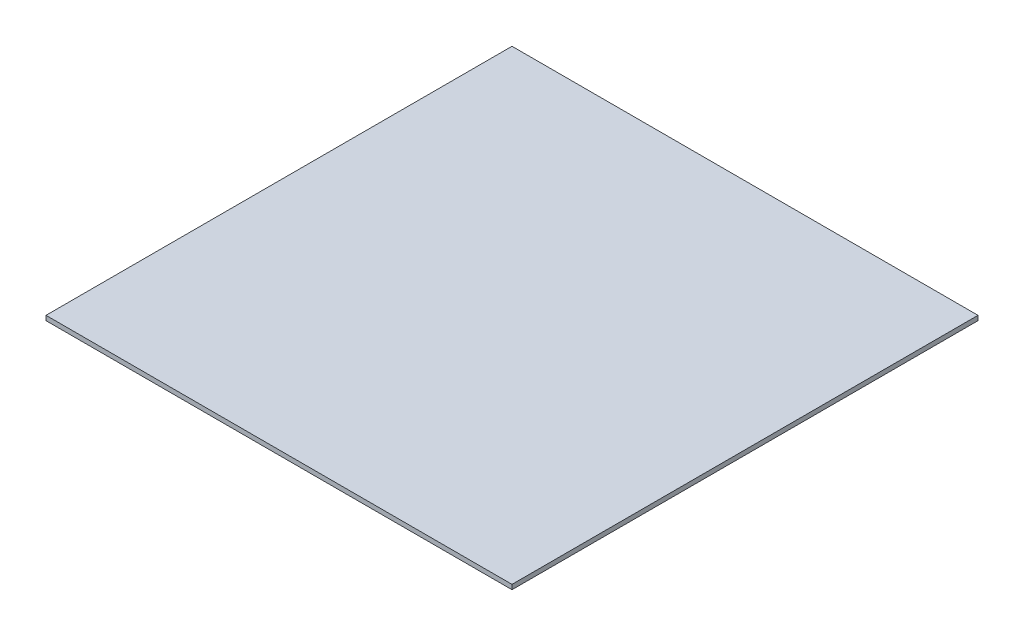
ISO-10303-21;
HEADER;
FILE_DESCRIPTION(('STEP AP214'),'2;1');
FILE_NAME('part.step','',(''),(''),'','','');
FILE_SCHEMA(('AUTOMOTIVE_DESIGN { 1 0 10303 214 1 1 1 1 }'));
ENDSEC;
DATA;
#1=APPLICATION_CONTEXT('core data for automotive mechanical design processes');
#2=APPLICATION_PROTOCOL_DEFINITION('international standard','automotive_design',2000,#1);
#3=PRODUCT_CONTEXT('',#1,'mechanical');
#4=PRODUCT('Part','Part','',(#3));
#5=PRODUCT_RELATED_PRODUCT_CATEGORY('part','',(#4));
#6=PRODUCT_DEFINITION_FORMATION('','',#4);
#7=PRODUCT_DEFINITION_CONTEXT('part definition',#1,'design');
#8=PRODUCT_DEFINITION('design','',#6,#7);
#9=PRODUCT_DEFINITION_SHAPE('','',#8);
#10=(LENGTH_UNIT() NAMED_UNIT(*) SI_UNIT(.MILLI.,.METRE.));
#11=(NAMED_UNIT(*) PLANE_ANGLE_UNIT() SI_UNIT($,.RADIAN.));
#12=(NAMED_UNIT(*) SI_UNIT($,.STERADIAN.) SOLID_ANGLE_UNIT());
#13=UNCERTAINTY_MEASURE_WITH_UNIT(LENGTH_MEASURE(1.E-05),#10,'distance_accuracy_value','');
#14=(GEOMETRIC_REPRESENTATION_CONTEXT(3) GLOBAL_UNCERTAINTY_ASSIGNED_CONTEXT((#13)) GLOBAL_UNIT_ASSIGNED_CONTEXT((#10,
#11,#12)) REPRESENTATION_CONTEXT('',''));
#15=CARTESIAN_POINT('',(0.,0.,0.));
#16=DIRECTION('',(0.,0.,1.));
#17=DIRECTION('',(1.,0.,0.));
#18=AXIS2_PLACEMENT_3D('',#15,#16,#17);
#19=CARTESIAN_POINT('',(-5000.00000000001,100.,5000.00000000001));
#20=DIRECTION('',(1.,0.,0.));
#21=DIRECTION('',(0.,0.,-1.));
#22=AXIS2_PLACEMENT_3D('',#19,#20,#21);
#23=PLANE('',#22);
#24=DIRECTION('',(0.,0.,1.));
#25=VECTOR('',#24,1.);
#26=CARTESIAN_POINT('',(-5000.00000000001,0.,5000.00000000001));
#27=LINE('',#26,#25);
#28=CARTESIAN_POINT('',(-5000.00000000001,0.,-4999.99999999999));
#29=VERTEX_POINT('',#28);
#30=CARTESIAN_POINT('',(-5000.00000000001,0.,5000.00000000001));
#31=VERTEX_POINT('',#30);
#32=EDGE_CURVE('E107',#29,#31,#27,.T.);
#33=ORIENTED_EDGE('',*,*,#32,.T.);
#34=DIRECTION('',(0.,-1.,0.));
#35=VECTOR('',#34,1.);
#36=CARTESIAN_POINT('',(-5000.00000000001,100.,5000.00000000001));
#37=LINE('',#36,#35);
#38=CARTESIAN_POINT('',(-5000.00000000001,100.,5000.00000000001));
#39=VERTEX_POINT('',#38);
#40=EDGE_CURVE('E11',#39,#31,#37,.T.);
#41=ORIENTED_EDGE('',*,*,#40,.F.);
#42=DIRECTION('',(0.,0.,1.));
#43=VECTOR('',#42,1.);
#44=CARTESIAN_POINT('',(-5000.00000000001,100.,5000.00000000001));
#45=LINE('',#44,#43);
#46=CARTESIAN_POINT('',(-5000.00000000001,100.,-4999.99999999999));
#47=VERTEX_POINT('',#46);
#48=EDGE_CURVE('E91',#47,#39,#45,.T.);
#49=ORIENTED_EDGE('',*,*,#48,.F.);
#50=DIRECTION('',(0.,-1.,0.));
#51=VECTOR('',#50,1.);
#52=CARTESIAN_POINT('',(-5000.00000000001,100.,-4999.99999999999));
#53=LINE('',#52,#51);
#54=EDGE_CURVE('E103',#47,#29,#53,.T.);
#55=ORIENTED_EDGE('',*,*,#54,.T.);
#56=EDGE_LOOP('',(#33,#41,#49,#55));
#57=FACE_BOUND('',#56,.T.);
#58=ADVANCED_FACE('F39',(#57),#23,.F.);
#59=CARTESIAN_POINT('',(4999.99999999999,100.,5000.00000000001));
#60=DIRECTION('',(0.,0.,-1.));
#61=DIRECTION('',(-1.,0.,0.));
#62=AXIS2_PLACEMENT_3D('',#59,#60,#61);
#63=PLANE('',#62);
#64=DIRECTION('',(1.,0.,0.));
#65=VECTOR('',#64,1.);
#66=CARTESIAN_POINT('',(4999.99999999999,0.,5000.00000000001));
#67=LINE('',#66,#65);
#68=CARTESIAN_POINT('',(4999.99999999999,0.,5000.00000000001));
#69=VERTEX_POINT('',#68);
#70=EDGE_CURVE('E96',#31,#69,#67,.T.);
#71=ORIENTED_EDGE('',*,*,#70,.T.);
#72=DIRECTION('',(0.,-1.,0.));
#73=VECTOR('',#72,1.);
#74=CARTESIAN_POINT('',(4999.99999999999,100.,5000.00000000001));
#75=LINE('',#74,#73);
#76=CARTESIAN_POINT('',(4999.99999999999,100.,5000.00000000001));
#77=VERTEX_POINT('',#76);
#78=EDGE_CURVE('E48',#77,#69,#75,.T.);
#79=ORIENTED_EDGE('',*,*,#78,.F.);
#80=DIRECTION('',(1.,0.,0.));
#81=VECTOR('',#80,1.);
#82=CARTESIAN_POINT('',(4999.99999999999,100.,5000.00000000001));
#83=LINE('',#82,#81);
#84=EDGE_CURVE('E86',#39,#77,#83,.T.);
#85=ORIENTED_EDGE('',*,*,#84,.F.);
#86=ORIENTED_EDGE('',*,*,#40,.T.);
#87=EDGE_LOOP('',(#71,#79,#85,#86));
#88=FACE_BOUND('',#87,.T.);
#89=ADVANCED_FACE('F95',(#88),#63,.F.);
#90=CARTESIAN_POINT('',(4999.99999999999,100.,5000.00000000001));
#91=DIRECTION('',(-1.,0.,0.));
#92=DIRECTION('',(0.,0.,1.));
#93=AXIS2_PLACEMENT_3D('',#90,#91,#92);
#94=PLANE('',#93);
#95=DIRECTION('',(0.,0.,-1.));
#96=VECTOR('',#95,1.);
#97=CARTESIAN_POINT('',(4999.99999999999,0.,5000.00000000001));
#98=LINE('',#97,#96);
#99=CARTESIAN_POINT('',(4999.99999999999,0.,-4999.99999999999));
#100=VERTEX_POINT('',#99);
#101=EDGE_CURVE('E73',#69,#100,#98,.T.);
#102=ORIENTED_EDGE('',*,*,#101,.T.);
#103=DIRECTION('',(0.,-1.,0.));
#104=VECTOR('',#103,1.);
#105=CARTESIAN_POINT('',(4999.99999999999,100.,-4999.99999999999));
#106=LINE('',#105,#104);
#107=CARTESIAN_POINT('',(4999.99999999999,100.,-4999.99999999999));
#108=VERTEX_POINT('',#107);
#109=EDGE_CURVE('E98',#108,#100,#106,.T.);
#110=ORIENTED_EDGE('',*,*,#109,.F.);
#111=DIRECTION('',(0.,0.,-1.));
#112=VECTOR('',#111,1.);
#113=CARTESIAN_POINT('',(4999.99999999999,100.,5000.00000000001));
#114=LINE('',#113,#112);
#115=EDGE_CURVE('E89',#77,#108,#114,.T.);
#116=ORIENTED_EDGE('',*,*,#115,.F.);
#117=ORIENTED_EDGE('',*,*,#78,.T.);
#118=EDGE_LOOP('',(#102,#110,#116,#117));
#119=FACE_BOUND('',#118,.T.);
#120=ADVANCED_FACE('F99',(#119),#94,.F.);
#121=CARTESIAN_POINT('',(4999.99999999999,100.,-4999.99999999999));
#122=DIRECTION('',(0.,0.,1.));
#123=DIRECTION('',(1.,0.,0.));
#124=AXIS2_PLACEMENT_3D('',#121,#122,#123);
#125=PLANE('',#124);
#126=DIRECTION('',(-1.,0.,0.));
#127=VECTOR('',#126,1.);
#128=CARTESIAN_POINT('',(4999.99999999999,0.,-4999.99999999999));
#129=LINE('',#128,#127);
#130=EDGE_CURVE('E79',#100,#29,#129,.T.);
#131=ORIENTED_EDGE('',*,*,#130,.T.);
#132=ORIENTED_EDGE('',*,*,#54,.F.);
#133=DIRECTION('',(-1.,0.,0.));
#134=VECTOR('',#133,1.);
#135=CARTESIAN_POINT('',(4999.99999999999,100.,-4999.99999999999));
#136=LINE('',#135,#134);
#137=EDGE_CURVE('E56',#108,#47,#136,.T.);
#138=ORIENTED_EDGE('',*,*,#137,.F.);
#139=ORIENTED_EDGE('',*,*,#109,.T.);
#140=EDGE_LOOP('',(#131,#132,#138,#139));
#141=FACE_BOUND('',#140,.T.);
#142=ADVANCED_FACE('F120',(#141),#125,.F.);
#143=CARTESIAN_POINT('',(0.,100.,0.));
#144=DIRECTION('',(0.,1.,0.));
#145=DIRECTION('',(0.,0.,1.));
#146=AXIS2_PLACEMENT_3D('',#143,#144,#145);
#147=PLANE('',#146);
#148=ORIENTED_EDGE('',*,*,#48,.T.);
#149=ORIENTED_EDGE('',*,*,#84,.T.);
#150=ORIENTED_EDGE('',*,*,#115,.T.);
#151=ORIENTED_EDGE('',*,*,#137,.T.);
#152=EDGE_LOOP('',(#148,#149,#150,#151));
#153=FACE_BOUND('',#152,.T.);
#154=ADVANCED_FACE('F87',(#153),#147,.T.);
#155=CARTESIAN_POINT('',(0.,0.,0.));
#156=DIRECTION('',(0.,1.,0.));
#157=DIRECTION('',(0.,0.,1.));
#158=AXIS2_PLACEMENT_3D('',#155,#156,#157);
#159=PLANE('',#158);
#160=ORIENTED_EDGE('',*,*,#32,.F.);
#161=ORIENTED_EDGE('',*,*,#130,.F.);
#162=ORIENTED_EDGE('',*,*,#101,.F.);
#163=ORIENTED_EDGE('',*,*,#70,.F.);
#164=EDGE_LOOP('',(#160,#161,#162,#163));
#165=FACE_BOUND('',#164,.T.);
#166=ADVANCED_FACE('F123',(#165),#159,.F.);
#167=CLOSED_SHELL('',(#58,#89,#120,#142,#154,#166));
#168=MANIFOLD_SOLID_BREP('B2',#167);
#169=ADVANCED_BREP_SHAPE_REPRESENTATION('',(#18,#168),#14);
#170=SHAPE_DEFINITION_REPRESENTATION(#9,#169);
ENDSEC;
END-ISO-10303-21;
